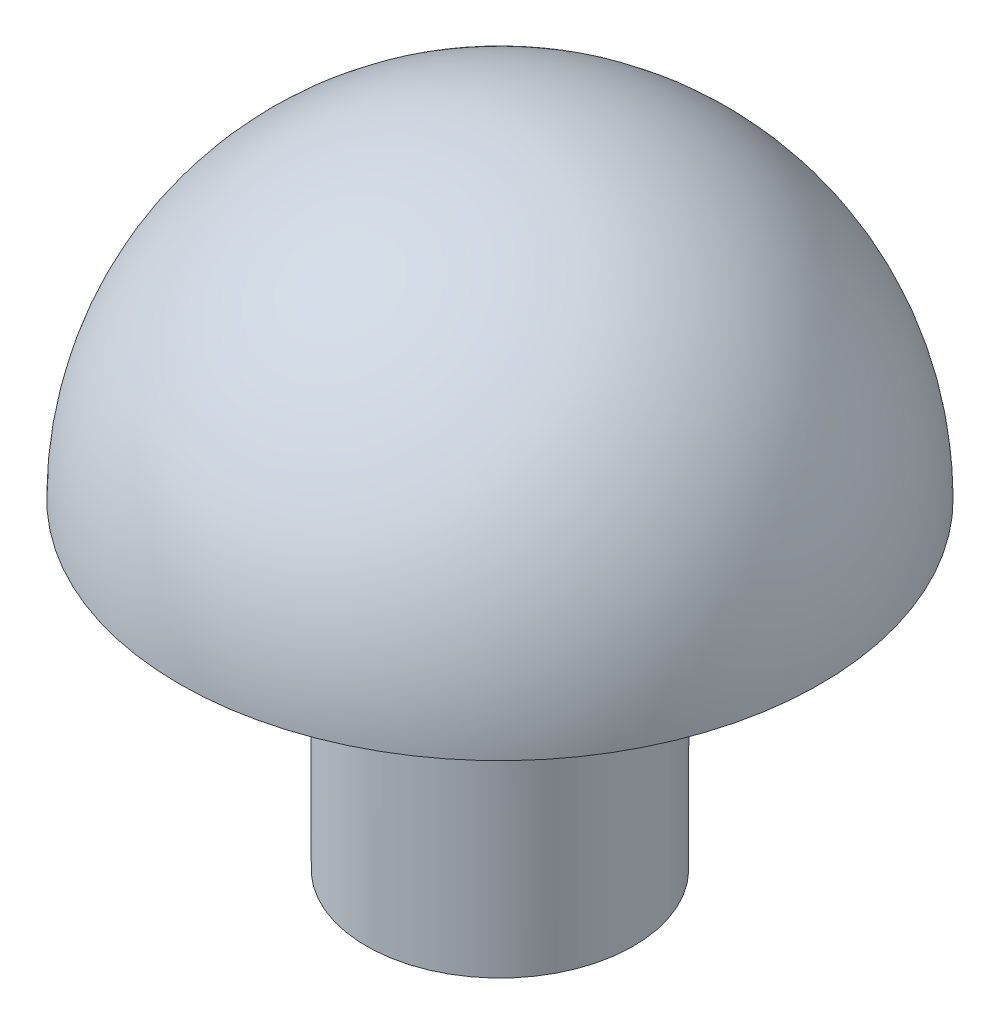
ISO-10303-21;
HEADER;
FILE_DESCRIPTION(('STEP AP214'),'2;1');
FILE_NAME('part.step','',(''),(''),'','','');
FILE_SCHEMA(('AUTOMOTIVE_DESIGN { 1 0 10303 214 1 1 1 1 }'));
ENDSEC;
DATA;
#1=APPLICATION_CONTEXT('core data for automotive mechanical design processes');
#2=APPLICATION_PROTOCOL_DEFINITION('international standard','automotive_design',2000,#1);
#3=PRODUCT_CONTEXT('',#1,'mechanical');
#4=PRODUCT('Part','Part','',(#3));
#5=PRODUCT_RELATED_PRODUCT_CATEGORY('part','',(#4));
#6=PRODUCT_DEFINITION_FORMATION('','',#4);
#7=PRODUCT_DEFINITION_CONTEXT('part definition',#1,'design');
#8=PRODUCT_DEFINITION('design','',#6,#7);
#9=PRODUCT_DEFINITION_SHAPE('','',#8);
#10=(LENGTH_UNIT() NAMED_UNIT(*) SI_UNIT(.MILLI.,.METRE.));
#11=(NAMED_UNIT(*) PLANE_ANGLE_UNIT() SI_UNIT($,.RADIAN.));
#12=(NAMED_UNIT(*) SI_UNIT($,.STERADIAN.) SOLID_ANGLE_UNIT());
#13=UNCERTAINTY_MEASURE_WITH_UNIT(LENGTH_MEASURE(1.E-05),#10,'distance_accuracy_value','');
#14=(GEOMETRIC_REPRESENTATION_CONTEXT(3) GLOBAL_UNCERTAINTY_ASSIGNED_CONTEXT((#13)) GLOBAL_UNIT_ASSIGNED_CONTEXT((#10,
#11,#12)) REPRESENTATION_CONTEXT('',''));
#15=CARTESIAN_POINT('',(0.,0.,0.));
#16=DIRECTION('',(0.,0.,1.));
#17=DIRECTION('',(1.,0.,0.));
#18=AXIS2_PLACEMENT_3D('',#15,#16,#17);
#19=CARTESIAN_POINT('',(0.,3.,0.));
#20=DIRECTION('',(0.,-1.,0.));
#21=DIRECTION('',(0.,0.,-1.));
#22=AXIS2_PLACEMENT_3D('',#19,#20,#21);
#23=CYLINDRICAL_SURFACE('',#22,2.5);
#24=CARTESIAN_POINT('',(0.,3.,0.));
#25=DIRECTION('',(0.,1.,0.));
#26=DIRECTION('',(0.,0.,1.));
#27=AXIS2_PLACEMENT_3D('',#24,#25,#26);
#28=CIRCLE('',#27,2.5);
#29=CARTESIAN_POINT('',(0.,3.,2.5));
#30=VERTEX_POINT('',#29);
#31=EDGE_CURVE('E10',#30,#30,#28,.T.);
#32=ORIENTED_EDGE('',*,*,#31,.F.);
#33=EDGE_LOOP('',(#32));
#34=FACE_BOUND('',#33,.T.);
#35=CARTESIAN_POINT('',(0.,-3.,0.));
#36=DIRECTION('',(0.,-1.,0.));
#37=DIRECTION('',(0.,0.,-1.));
#38=AXIS2_PLACEMENT_3D('',#35,#36,#37);
#39=CIRCLE('',#38,2.5);
#40=CARTESIAN_POINT('',(0.,-3.,-2.5));
#41=VERTEX_POINT('',#40);
#42=EDGE_CURVE('E41',#41,#41,#39,.T.);
#43=ORIENTED_EDGE('',*,*,#42,.F.);
#44=EDGE_LOOP('',(#43));
#45=FACE_BOUND('',#44,.T.);
#46=ADVANCED_FACE('F31',(#34,#45),#23,.T.);
#47=CARTESIAN_POINT('',(0.,3.,0.));
#48=DIRECTION('',(0.,-1.,0.));
#49=DIRECTION('',(0.,0.,1.));
#50=AXIS2_PLACEMENT_3D('',#47,#48,#49);
#51=PLANE('',#50);
#52=CARTESIAN_POINT('',(0.,3.,0.));
#53=DIRECTION('',(0.,-1.,0.));
#54=DIRECTION('',(0.,0.,1.));
#55=AXIS2_PLACEMENT_3D('',#52,#53,#54);
#56=CIRCLE('',#55,6.);
#57=CARTESIAN_POINT('',(0.,3.,6.));
#58=VERTEX_POINT('',#57);
#59=EDGE_CURVE('E37',#58,#58,#56,.T.);
#60=ORIENTED_EDGE('',*,*,#59,.T.);
#61=EDGE_LOOP('',(#60));
#62=FACE_BOUND('',#61,.T.);
#63=ORIENTED_EDGE('',*,*,#31,.T.);
#64=EDGE_LOOP('',(#63));
#65=FACE_BOUND('',#64,.T.);
#66=ADVANCED_FACE('F51',(#62,#65),#51,.T.);
#67=CARTESIAN_POINT('',(0.,3.,0.));
#68=DIRECTION('',(0.,0.,-1.));
#69=DIRECTION('',(-1.,0.,0.));
#70=AXIS2_PLACEMENT_3D('',#67,#68,#69);
#71=SPHERICAL_SURFACE('',#70,6.);
#72=CARTESIAN_POINT('',(0.,3.,0.));
#73=DIRECTION('',(0.,-1.,0.));
#74=DIRECTION('',(0.,0.,1.));
#75=AXIS2_PLACEMENT_3D('',#72,#73,#74);
#76=SPHERICAL_SURFACE('',#75,6.);
#77=ORIENTED_EDGE('',*,*,#59,.F.);
#78=EDGE_LOOP('',(#77));
#79=FACE_BOUND('',#78,.T.);
#80=ADVANCED_FACE('F56',(#79),#76,.T.);
#81=CARTESIAN_POINT('',(0.,-3.,0.));
#82=DIRECTION('',(0.,-1.,0.));
#83=DIRECTION('',(0.,0.,-1.));
#84=AXIS2_PLACEMENT_3D('',#81,#82,#83);
#85=PLANE('',#84);
#86=ORIENTED_EDGE('',*,*,#42,.T.);
#87=EDGE_LOOP('',(#86));
#88=FACE_BOUND('',#87,.T.);
#89=ADVANCED_FACE('F48',(#88),#85,.T.);
#90=CLOSED_SHELL('',(#46,#66,#80,#89));
#91=MANIFOLD_SOLID_BREP('B2',#90);
#92=ADVANCED_BREP_SHAPE_REPRESENTATION('',(#18,#91),#14);
#93=SHAPE_DEFINITION_REPRESENTATION(#9,#92);
ENDSEC;
END-ISO-10303-21;
